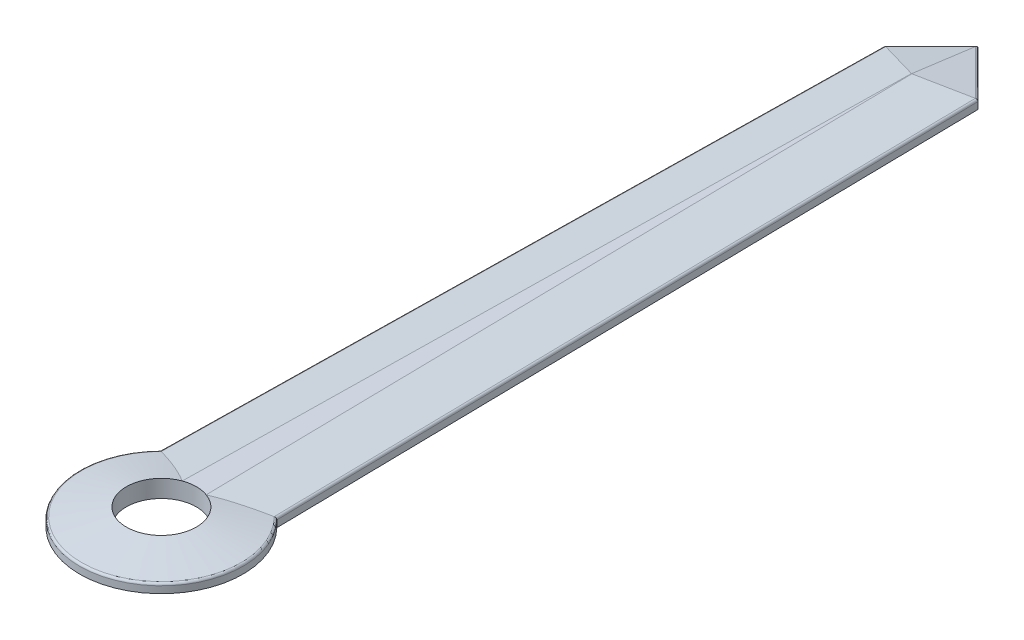
ISO-10303-21;
HEADER;
FILE_DESCRIPTION(('STEP AP214'),'2;1');
FILE_NAME('part.step','',(''),(''),'','','');
FILE_SCHEMA(('AUTOMOTIVE_DESIGN { 1 0 10303 214 1 1 1 1 }'));
ENDSEC;
DATA;
#1=APPLICATION_CONTEXT('core data for automotive mechanical design processes');
#2=APPLICATION_PROTOCOL_DEFINITION('international standard','automotive_design',2000,#1);
#3=PRODUCT_CONTEXT('',#1,'mechanical');
#4=PRODUCT('Part','Part','',(#3));
#5=PRODUCT_RELATED_PRODUCT_CATEGORY('part','',(#4));
#6=PRODUCT_DEFINITION_FORMATION('','',#4);
#7=PRODUCT_DEFINITION_CONTEXT('part definition',#1,'design');
#8=PRODUCT_DEFINITION('design','',#6,#7);
#9=PRODUCT_DEFINITION_SHAPE('','',#8);
#10=(LENGTH_UNIT() NAMED_UNIT(*) SI_UNIT(.MILLI.,.METRE.));
#11=(NAMED_UNIT(*) PLANE_ANGLE_UNIT() SI_UNIT($,.RADIAN.));
#12=(NAMED_UNIT(*) SI_UNIT($,.STERADIAN.) SOLID_ANGLE_UNIT());
#13=UNCERTAINTY_MEASURE_WITH_UNIT(LENGTH_MEASURE(1.E-05),#10,'distance_accuracy_value','');
#14=(GEOMETRIC_REPRESENTATION_CONTEXT(3) GLOBAL_UNCERTAINTY_ASSIGNED_CONTEXT((#13)) GLOBAL_UNIT_ASSIGNED_CONTEXT((#10,
#11,#12)) REPRESENTATION_CONTEXT('',''));
#15=CARTESIAN_POINT('',(0.,0.,0.));
#16=DIRECTION('',(0.,0.,1.));
#17=DIRECTION('',(1.,0.,0.));
#18=AXIS2_PLACEMENT_3D('',#15,#16,#17);
#19=CARTESIAN_POINT('',(0.,0.1905,0.));
#20=DIRECTION('',(0.,1.,0.));
#21=DIRECTION('',(0.,0.,1.));
#22=AXIS2_PLACEMENT_3D('',#19,#20,#21);
#23=PLANE('',#22);
#24=CARTESIAN_POINT('',(0.,0.1905,0.));
#25=DIRECTION('',(0.,1.,0.));
#26=DIRECTION('',(0.,0.,1.));
#27=AXIS2_PLACEMENT_3D('',#24,#25,#26);
#28=CIRCLE('',#27,0.380999999999999);
#29=CARTESIAN_POINT('',(0.130290982169233,0.1905,-0.358029691457812));
#30=VERTEX_POINT('',#29);
#31=CARTESIAN_POINT('',(-0.130290982169233,0.1905,-0.358029691457812));
#32=VERTEX_POINT('',#31);
#33=EDGE_CURVE('E171',#30,#32,#28,.T.);
#34=ORIENTED_EDGE('',*,*,#33,.F.);
#35=DIRECTION('',(-0.0163641472754282,0.,-0.999866098377152));
#36=VECTOR('',#35,1.);
#37=CARTESIAN_POINT('',(-0.000895722754283927,0.1905,-8.37367124021056));
#38=LINE('',#37,#36);
#39=CARTESIAN_POINT('',(0.00247458824657965,0.1905,-8.16774179860675));
#40=VERTEX_POINT('',#39);
#41=EDGE_CURVE('E212',#30,#40,#38,.T.);
#42=ORIENTED_EDGE('',*,*,#41,.T.);
#43=DIRECTION('',(-0.707106781186548,0.,-0.707106781186547));
#44=VECTOR('',#43,1.);
#45=CARTESIAN_POINT('',(-0.359891806573333,0.1905,-8.53010819342667));
#46=LINE('',#45,#44);
#47=CARTESIAN_POINT('',(0.,0.1905,-8.17021638685333));
#48=VERTEX_POINT('',#47);
#49=EDGE_CURVE('E208',#40,#48,#46,.T.);
#50=ORIENTED_EDGE('',*,*,#49,.T.);
#51=DIRECTION('',(-0.707106781186548,0.,0.707106781186547));
#52=VECTOR('',#51,1.);
#53=CARTESIAN_POINT('',(-0.148108193426666,0.1905,-8.02210819342667));
#54=LINE('',#53,#52);
#55=CARTESIAN_POINT('',(-0.00247458824657978,0.1905,-8.16774179860675));
#56=VERTEX_POINT('',#55);
#57=EDGE_CURVE('E205',#48,#56,#54,.T.);
#58=ORIENTED_EDGE('',*,*,#57,.T.);
#59=DIRECTION('',(-0.0163641472754282,0.,0.999866098377152));
#60=VECTOR('',#59,1.);
#61=CARTESIAN_POINT('',(-0.126104277245716,0.1905,-0.613841634877489));
#62=LINE('',#61,#60);
#63=EDGE_CURVE('E202',#56,#32,#62,.T.);
#64=ORIENTED_EDGE('',*,*,#63,.T.);
#65=EDGE_LOOP('',(#34,#42,#50,#58,#64));
#66=FACE_BOUND('',#65,.T.);
#67=ADVANCED_FACE('F43',(#66),#23,.T.);
#68=CARTESIAN_POINT('',(0.,0.,0.));
#69=DIRECTION('',(0.,1.,0.));
#70=DIRECTION('',(0.,0.,1.));
#71=AXIS2_PLACEMENT_3D('',#68,#69,#70);
#72=PLANE('',#71);
#73=CARTESIAN_POINT('',(0.,0.,0.));
#74=DIRECTION('',(0.,1.,0.));
#75=DIRECTION('',(0.,0.,1.));
#76=AXIS2_PLACEMENT_3D('',#73,#74,#75);
#77=CIRCLE('',#76,0.889);
#78=CARTESIAN_POINT('',(-0.635,0.,-0.622170394666927));
#79=VERTEX_POINT('',#78);
#80=CARTESIAN_POINT('',(0.635,0.,-0.622170394666927));
#81=VERTEX_POINT('',#80);
#82=EDGE_CURVE('E162',#79,#81,#77,.T.);
#83=ORIENTED_EDGE('',*,*,#82,.F.);
#84=DIRECTION('',(-0.0163641472754282,0.,0.999866098377152));
#85=VECTOR('',#84,1.);
#86=CARTESIAN_POINT('',(-0.635,0.,-0.622170394666927));
#87=LINE('',#86,#85);
#88=CARTESIAN_POINT('',(-0.508,0.,-8.382));
#89=VERTEX_POINT('',#88);
#90=EDGE_CURVE('E184',#89,#79,#87,.T.);
#91=ORIENTED_EDGE('',*,*,#90,.F.);
#92=DIRECTION('',(-0.707106781186548,0.,0.707106781186547));
#93=VECTOR('',#92,1.);
#94=CARTESIAN_POINT('',(-0.508,0.,-8.382));
#95=LINE('',#94,#93);
#96=CARTESIAN_POINT('',(0.,0.,-8.89));
#97=VERTEX_POINT('',#96);
#98=EDGE_CURVE('E180',#97,#89,#95,.T.);
#99=ORIENTED_EDGE('',*,*,#98,.F.);
#100=DIRECTION('',(-0.707106781186548,0.,-0.707106781186547));
#101=VECTOR('',#100,1.);
#102=CARTESIAN_POINT('',(0.,0.,-8.89));
#103=LINE('',#102,#101);
#104=CARTESIAN_POINT('',(0.508,0.,-8.382));
#105=VERTEX_POINT('',#104);
#106=EDGE_CURVE('E165',#105,#97,#103,.T.);
#107=ORIENTED_EDGE('',*,*,#106,.F.);
#108=DIRECTION('',(-0.0163641472754282,0.,-0.999866098377152));
#109=VECTOR('',#108,1.);
#110=CARTESIAN_POINT('',(0.508,0.,-8.382));
#111=LINE('',#110,#109);
#112=EDGE_CURVE('E149',#81,#105,#111,.T.);
#113=ORIENTED_EDGE('',*,*,#112,.F.);
#114=EDGE_LOOP('',(#83,#91,#99,#107,#113));
#115=FACE_BOUND('',#114,.T.);
#116=CARTESIAN_POINT('',(0.,0.,0.));
#117=DIRECTION('',(0.,1.,0.));
#118=DIRECTION('',(0.,0.,1.));
#119=AXIS2_PLACEMENT_3D('',#116,#117,#118);
#120=CIRCLE('',#119,0.380999999999999);
#121=CARTESIAN_POINT('',(0.,0.,0.380999999999999));
#122=VERTEX_POINT('',#121);
#123=EDGE_CURVE('E174',#122,#122,#120,.T.);
#124=ORIENTED_EDGE('',*,*,#123,.T.);
#125=EDGE_LOOP('',(#124));
#126=FACE_BOUND('',#125,.T.);
#127=ADVANCED_FACE('F159',(#115,#126),#72,.F.);
#128=CARTESIAN_POINT('',(0.,0.1905,0.));
#129=DIRECTION('',(0.,-1.,0.));
#130=DIRECTION('',(0.,0.,-1.));
#131=AXIS2_PLACEMENT_3D('',#128,#129,#130);
#132=CYLINDRICAL_SURFACE('',#131,0.889);
#133=DIRECTION('',(0.,-1.,0.));
#134=VECTOR('',#133,1.);
#135=CARTESIAN_POINT('',(0.635,0.1905,-0.622170394666927));
#136=LINE('',#135,#134);
#137=CARTESIAN_POINT('',(0.635,0.0741625137147924,-0.622170394666927));
#138=VERTEX_POINT('',#137);
#139=EDGE_CURVE('E145',#138,#81,#136,.T.);
#140=ORIENTED_EDGE('',*,*,#139,.F.);
#141=CARTESIAN_POINT('',(0.,0.0741625137147923,0.));
#142=DIRECTION('',(0.,1.,0.));
#143=DIRECTION('',(0.,0.,1.));
#144=AXIS2_PLACEMENT_3D('',#141,#142,#143);
#145=CIRCLE('',#144,0.889);
#146=CARTESIAN_POINT('',(-0.635,0.0741625137147924,-0.622170394666927));
#147=VERTEX_POINT('',#146);
#148=EDGE_CURVE('E57',#138,#147,#145,.F.);
#149=ORIENTED_EDGE('',*,*,#148,.T.);
#150=DIRECTION('',(0.,-1.,0.));
#151=VECTOR('',#150,1.);
#152=CARTESIAN_POINT('',(-0.635,0.1905,-0.622170394666927));
#153=LINE('',#152,#151);
#154=EDGE_CURVE('E169',#147,#79,#153,.T.);
#155=ORIENTED_EDGE('',*,*,#154,.T.);
#156=ORIENTED_EDGE('',*,*,#82,.T.);
#157=EDGE_LOOP('',(#140,#149,#155,#156));
#158=FACE_BOUND('',#157,.T.);
#159=ADVANCED_FACE('F168',(#158),#132,.T.);
#160=CARTESIAN_POINT('',(0.508,0.1905,-8.382));
#161=DIRECTION('',(-0.999866098377152,0.,0.0163641472754282));
#162=DIRECTION('',(0.0163641472754282,0.,0.999866098377152));
#163=AXIS2_PLACEMENT_3D('',#160,#161,#162);
#164=PLANE('',#163);
#165=DIRECTION('',(0.,-1.,0.));
#166=VECTOR('',#165,1.);
#167=CARTESIAN_POINT('',(0.508,0.1905,-8.382));
#168=LINE('',#167,#166);
#169=CARTESIAN_POINT('',(0.508,0.0741625137147924,-8.382));
#170=VERTEX_POINT('',#169);
#171=EDGE_CURVE('E155',#170,#105,#168,.T.);
#172=ORIENTED_EDGE('',*,*,#171,.F.);
#173=DIRECTION('',(0.0163641472754282,0.,0.999866098377152));
#174=VECTOR('',#173,1.);
#175=CARTESIAN_POINT('',(0.635,0.0741625137147924,-0.622170394666927));
#176=LINE('',#175,#174);
#177=EDGE_CURVE('E152',#170,#138,#176,.T.);
#178=ORIENTED_EDGE('',*,*,#177,.T.);
#179=ORIENTED_EDGE('',*,*,#139,.T.);
#180=ORIENTED_EDGE('',*,*,#112,.T.);
#181=EDGE_LOOP('',(#172,#178,#179,#180));
#182=FACE_BOUND('',#181,.T.);
#183=ADVANCED_FACE('F148',(#182),#164,.F.);
#184=CARTESIAN_POINT('',(0.,0.1905,-8.89));
#185=DIRECTION('',(-0.707106781186547,0.,0.707106781186548));
#186=DIRECTION('',(0.707106781186548,0.,0.707106781186547));
#187=AXIS2_PLACEMENT_3D('',#184,#185,#186);
#188=PLANE('',#187);
#189=DIRECTION('',(0.,-1.,0.));
#190=VECTOR('',#189,1.);
#191=CARTESIAN_POINT('',(0.,0.1905,-8.89));
#192=LINE('',#191,#190);
#193=CARTESIAN_POINT('',(0.,0.0741625137147924,-8.89));
#194=VERTEX_POINT('',#193);
#195=EDGE_CURVE('E191',#194,#97,#192,.T.);
#196=ORIENTED_EDGE('',*,*,#195,.F.);
#197=DIRECTION('',(0.707106781186548,0.,0.707106781186547));
#198=VECTOR('',#197,1.);
#199=CARTESIAN_POINT('',(0.508,0.0741625137147922,-8.382));
#200=LINE('',#199,#198);
#201=EDGE_CURVE('E216',#194,#170,#200,.T.);
#202=ORIENTED_EDGE('',*,*,#201,.T.);
#203=ORIENTED_EDGE('',*,*,#171,.T.);
#204=ORIENTED_EDGE('',*,*,#106,.T.);
#205=EDGE_LOOP('',(#196,#202,#203,#204));
#206=FACE_BOUND('',#205,.T.);
#207=ADVANCED_FACE('F346',(#206),#188,.F.);
#208=CARTESIAN_POINT('',(-0.508,0.1905,-8.382));
#209=DIRECTION('',(0.707106781186547,0.,0.707106781186548));
#210=DIRECTION('',(0.707106781186548,0.,-0.707106781186547));
#211=AXIS2_PLACEMENT_3D('',#208,#209,#210);
#212=PLANE('',#211);
#213=DIRECTION('',(0.,-1.,0.));
#214=VECTOR('',#213,1.);
#215=CARTESIAN_POINT('',(-0.508,0.1905,-8.382));
#216=LINE('',#215,#214);
#217=CARTESIAN_POINT('',(-0.508,0.0741625137147924,-8.382));
#218=VERTEX_POINT('',#217);
#219=EDGE_CURVE('E188',#218,#89,#216,.T.);
#220=ORIENTED_EDGE('',*,*,#219,.F.);
#221=DIRECTION('',(0.707106781186548,0.,-0.707106781186547));
#222=VECTOR('',#221,1.);
#223=CARTESIAN_POINT('',(0.,0.0741625137147922,-8.89));
#224=LINE('',#223,#222);
#225=EDGE_CURVE('E314',#218,#194,#224,.T.);
#226=ORIENTED_EDGE('',*,*,#225,.T.);
#227=ORIENTED_EDGE('',*,*,#195,.T.);
#228=ORIENTED_EDGE('',*,*,#98,.T.);
#229=EDGE_LOOP('',(#220,#226,#227,#228));
#230=FACE_BOUND('',#229,.T.);
#231=ADVANCED_FACE('F348',(#230),#212,.F.);
#232=CARTESIAN_POINT('',(-0.635,0.1905,-0.622170394666927));
#233=DIRECTION('',(0.999866098377152,0.,0.0163641472754282));
#234=DIRECTION('',(0.0163641472754282,0.,-0.999866098377152));
#235=AXIS2_PLACEMENT_3D('',#232,#233,#234);
#236=PLANE('',#235);
#237=ORIENTED_EDGE('',*,*,#154,.F.);
#238=DIRECTION('',(0.0163641472754282,0.,-0.999866098377152));
#239=VECTOR('',#238,1.);
#240=CARTESIAN_POINT('',(-0.508,0.0741625137147924,-8.382));
#241=LINE('',#240,#239);
#242=EDGE_CURVE('E287',#147,#218,#241,.T.);
#243=ORIENTED_EDGE('',*,*,#242,.T.);
#244=ORIENTED_EDGE('',*,*,#219,.T.);
#245=ORIENTED_EDGE('',*,*,#90,.T.);
#246=EDGE_LOOP('',(#237,#243,#244,#245));
#247=FACE_BOUND('',#246,.T.);
#248=ADVANCED_FACE('F349',(#247),#236,.F.);
#249=CARTESIAN_POINT('',(0.,0.1905,0.));
#250=DIRECTION('',(0.,-1.,0.));
#251=DIRECTION('',(0.,0.,-1.));
#252=AXIS2_PLACEMENT_3D('',#249,#250,#251);
#253=CYLINDRICAL_SURFACE('',#252,0.380999999999999);
#254=CARTESIAN_POINT('',(0.,0.190319615913308,0.));
#255=DIRECTION('',(0.,-1.,0.));
#256=DIRECTION('',(0.,0.,-1.));
#257=AXIS2_PLACEMENT_3D('',#254,#255,#256);
#258=CIRCLE('',#257,0.380999999999999);
#259=CARTESIAN_POINT('',(-0.131260785505618,0.190319615913316,-0.357675280370964));
#260=VERTEX_POINT('',#259);
#261=CARTESIAN_POINT('',(0.131260785505618,0.190319615913308,-0.357675280370964));
#262=VERTEX_POINT('',#261);
#263=EDGE_CURVE('E197',#260,#262,#258,.F.);
#264=ORIENTED_EDGE('',*,*,#263,.T.);
#265=CARTESIAN_POINT('',(0.,0.215976483675146,0.));
#266=DIRECTION('',(0.183926719228348,0.982935349149554,-0.00301020699294048));
#267=DIRECTION('',(0.982803732511148,-0.18395135061272,-0.0160848988157077));
#268=AXIS2_PLACEMENT_3D('',#265,#266,#267);
#269=ELLIPSE('',#268,0.387614506213094,0.380999999999999);
#270=EDGE_CURVE('E200',#262,#30,#269,.T.);
#271=ORIENTED_EDGE('',*,*,#270,.T.);
#272=ORIENTED_EDGE('',*,*,#33,.T.);
#273=CARTESIAN_POINT('',(0.,0.215976483675146,0.));
#274=DIRECTION('',(-0.183926719228348,0.982935349149554,-0.00301020699294048));
#275=DIRECTION('',(-0.982803732511148,-0.18395135061272,-0.0160848988157078));
#276=AXIS2_PLACEMENT_3D('',#273,#274,#275);
#277=ELLIPSE('',#276,0.387614506213094,0.380999999999999);
#278=EDGE_CURVE('E154',#32,#260,#277,.T.);
#279=ORIENTED_EDGE('',*,*,#278,.T.);
#280=EDGE_LOOP('',(#264,#271,#272,#279));
#281=FACE_BOUND('',#280,.T.);
#282=ORIENTED_EDGE('',*,*,#123,.F.);
#283=EDGE_LOOP('',(#282));
#284=FACE_BOUND('',#283,.T.);
#285=ADVANCED_FACE('F249',(#281,#284),#253,.F.);
#286=CARTESIAN_POINT('',(-4.08510819342667,0.1905,-4.08510819342667));
#287=DIRECTION('',(-0.130073247426679,0.982935349149554,-0.130073247426679));
#288=DIRECTION('',(0.,0.13118776787575,0.991357538711326));
#289=AXIS2_PLACEMENT_3D('',#286,#287,#288);
#290=PLANE('',#289);
#291=DIRECTION('',(0.,-0.13118776787575,-0.991357538711326));
#292=VECTOR('',#291,1.);
#293=CARTESIAN_POINT('',(0.,0.721784590194362,-4.15541384680878));
#294=LINE('',#293,#292);
#295=CARTESIAN_POINT('',(0.,0.099129071583191,-8.860686696485));
#296=VERTEX_POINT('',#295);
#297=EDGE_CURVE('E318',#296,#48,#294,.F.);
#298=ORIENTED_EDGE('',*,*,#297,.F.);
#299=DIRECTION('',(0.707106781186548,0.,-0.707106781186547));
#300=VECTOR('',#299,1.);
#301=CARTESIAN_POINT('',(-0.493343348242499,0.0991290715831909,-8.3673433482425));
#302=LINE('',#301,#300);
#303=CARTESIAN_POINT('',(-0.487412396227678,0.0991290715831911,-8.37327430025732));
#304=VERTEX_POINT('',#303);
#305=EDGE_CURVE('E311',#296,#304,#302,.F.);
#306=ORIENTED_EDGE('',*,*,#305,.T.);
#307=DIRECTION('',(-0.907167863131854,-0.170926598256659,-0.384487406957877));
#308=VECTOR('',#307,1.);
#309=CARTESIAN_POINT('',(2.73563364095255,0.706408404933815,-7.00724198837286));
#310=LINE('',#309,#308);
#311=EDGE_CURVE('E322',#56,#304,#310,.T.);
#312=ORIENTED_EDGE('',*,*,#311,.F.);
#313=ORIENTED_EDGE('',*,*,#57,.F.);
#314=EDGE_LOOP('',(#298,#306,#312,#313));
#315=FACE_BOUND('',#314,.T.);
#316=ADVANCED_FACE('F245',(#315),#290,.T.);
#317=CARTESIAN_POINT('',(4.08510819342667,0.1905,-4.08510819342667));
#318=DIRECTION('',(0.130073247426679,0.982935349149554,-0.130073247426679));
#319=DIRECTION('',(0.,0.13118776787575,0.991357538711326));
#320=AXIS2_PLACEMENT_3D('',#317,#318,#319);
#321=PLANE('',#320);
#322=DIRECTION('',(0.907167863131854,-0.170926598256659,-0.384487406957878));
#323=VECTOR('',#322,1.);
#324=CARTESIAN_POINT('',(1.93829169872956,-0.174242455050791,-8.98820439588696));
#325=LINE('',#324,#323);
#326=CARTESIAN_POINT('',(0.487412396227678,0.099129071583191,-8.37327430025732));
#327=VERTEX_POINT('',#326);
#328=EDGE_CURVE('E319',#327,#40,#325,.F.);
#329=ORIENTED_EDGE('',*,*,#328,.F.);
#330=DIRECTION('',(0.707106781186548,0.,0.707106781186547));
#331=VECTOR('',#330,1.);
#332=CARTESIAN_POINT('',(-0.0146566517575008,0.0991290715831909,-8.8753433482425));
#333=LINE('',#332,#331);
#334=EDGE_CURVE('E309',#327,#296,#333,.F.);
#335=ORIENTED_EDGE('',*,*,#334,.T.);
#336=ORIENTED_EDGE('',*,*,#297,.T.);
#337=ORIENTED_EDGE('',*,*,#49,.F.);
#338=EDGE_LOOP('',(#329,#335,#336,#337));
#339=FACE_BOUND('',#338,.T.);
#340=ADVANCED_FACE('F242',(#339),#321,.T.);
#341=CARTESIAN_POINT('',(-0.136114158247782,0.1905,-0.00222769042320052));
#342=DIRECTION('',(-0.183926719228348,0.982935349149554,-0.00301020699294048));
#343=DIRECTION('',(-0.982939802538536,-0.183927552545845,0.));
#344=AXIS2_PLACEMENT_3D('',#341,#342,#343);
#345=PLANE('',#344);
#346=ORIENTED_EDGE('',*,*,#311,.T.);
#347=DIRECTION('',(0.0163641472754282,0.,-0.999866098377152));
#348=VECTOR('',#347,1.);
#349=CARTESIAN_POINT('',(-0.61427513976962,0.0991290715831911,-0.621831204583752));
#350=LINE('',#349,#348);
#351=CARTESIAN_POINT('',(-0.61441131251624,0.0991290715831926,-0.613510910798519));
#352=VERTEX_POINT('',#351);
#353=EDGE_CURVE('E65',#304,#352,#350,.F.);
#354=ORIENTED_EDGE('',*,*,#353,.T.);
#355=CARTESIAN_POINT('',(-1.47147255137392,-0.0621517655911384,-0.909893903828372));
#356=CARTESIAN_POINT('',(-1.40126561664907,-0.0489516430604869,-0.88931861528272));
#357=CARTESIAN_POINT('',(-1.33123256726205,-0.0357822712731719,-0.868159922647089));
#358=CARTESIAN_POINT('',(-1.19155517359173,-0.00951179945482843,-0.824385318027376));
#359=CARTESIAN_POINT('',(-1.12191114060924,0.00358924546163034,-0.801768382035371));
#360=CARTESIAN_POINT('',(-0.91180737219843,0.0431215576781161,-0.730673507034872));
#361=CARTESIAN_POINT('',(-0.772172257976581,0.0694067199513363,-0.679518649929991));
#362=CARTESIAN_POINT('',(-0.560869877669018,0.109216129447022,-0.591178463493681));
#363=CARTESIAN_POINT('',(-0.487459031921342,0.123053207294985,-0.558377751854708));
#364=CARTESIAN_POINT('',(-0.343527602704058,0.150202761355517,-0.487478697250913));
#365=CARTESIAN_POINT('',(-0.272995184279456,0.163517374645867,-0.449405653260168));
#366=CARTESIAN_POINT('',(-0.149537241978278,0.186855719724566,-0.372045498655669));
#367=CARTESIAN_POINT('',(-0.0957633088371803,0.197033555626133,-0.334276805966505));
#368=CARTESIAN_POINT('',(-0.021155913531705,0.211192563180673,-0.2694654537962));
#369=CARTESIAN_POINT('',(0.00286274626934901,0.215757892030189,-0.246294353145887));
#370=CARTESIAN_POINT('',(0.046850909684194,0.224142164765649,-0.196264748147143));
#371=CARTESIAN_POINT('',(0.0668457581203295,0.227965774640298,-0.169431233703665));
#372=CARTESIAN_POINT('',(0.0904704545488148,0.232515842293267,-0.127171870621056));
#373=CARTESIAN_POINT('',(0.0970812378010598,0.233794733459666,-0.113495847626509));
#374=CARTESIAN_POINT('',(0.108231955058883,0.23596765023619,-0.0852845424472507));
#375=CARTESIAN_POINT('',(0.112773698416452,0.236862012074228,-0.0707500236230778));
#376=CARTESIAN_POINT('',(0.119326509505099,0.23817953496342,-0.0409172659247494));
#377=CARTESIAN_POINT('',(0.121310138991908,0.238597581619502,-0.0256125469164558));
#378=CARTESIAN_POINT('',(0.122346333093547,0.23888548850571,0.0050863632700086));
#379=CARTESIAN_POINT('',(0.121403083838638,0.238756131556419,0.0204803952626585));
#380=CARTESIAN_POINT('',(0.116963744366099,0.238013338117826,0.0491811513962582));
#381=CARTESIAN_POINT('',(0.113750978057984,0.237453062228181,0.0625352461760626));
#382=CARTESIAN_POINT('',(0.105382207931775,0.235967093264305,0.0886560448923355));
#383=CARTESIAN_POINT('',(0.100217020058462,0.235039672173734,0.101419647647132));
#384=CARTESIAN_POINT('',(0.0846088482750408,0.2322186806122,0.133944820840169));
#385=CARTESIAN_POINT('',(0.0728899550909656,0.230084371444411,0.153056346869973));
#386=CARTESIAN_POINT('',(0.04690333013583,0.225331855140782,0.189006831279379));
#387=CARTESIAN_POINT('',(0.0326746133775238,0.222721036354855,0.205874481043181));
#388=CARTESIAN_POINT('',(0.017766486995649,0.219980200210557,0.221799645962157));
#389=B_SPLINE_CURVE_WITH_KNOTS('',3,(#355,#356,#357,#358,#359,#360,#361,#362,#363,#364,#365,
#366,#367,#368,#369,#370,#371,#372,#373,#374,#375,#376,#377,#378,#379,#380,#381,#382,#383,#384,
#385,#386,#387,#388),.UNSPECIFIED.,.F.,.F.,(4,2,2,2,2,2,2,2,2,2,2,2,2,2,2,2,4),(0.,
0.223001286945015,0.446160912348124,0.898804041303776,1.14341976037625,1.38689994820208,
1.58548346483561,1.68631638916805,1.78649281752304,1.83209118392024,1.87764959815471,
1.9236927138026,1.96967000725155,2.01073823503396,2.05200209870585,2.11922986502013,
2.18549230719106),.UNSPECIFIED.);
#390=EDGE_CURVE('E224',#260,#352,#389,.F.);
#391=ORIENTED_EDGE('',*,*,#390,.F.);
#392=ORIENTED_EDGE('',*,*,#278,.F.);
#393=ORIENTED_EDGE('',*,*,#63,.F.);
#394=EDGE_LOOP('',(#346,#354,#391,#392,#393));
#395=FACE_BOUND('',#394,.T.);
#396=ADVANCED_FACE('F237',(#395),#345,.T.);
#397=CARTESIAN_POINT('',(0.136114158247782,0.1905,-0.00222769042320051));
#398=DIRECTION('',(0.183926719228348,0.982935349149554,-0.00301020699294048));
#399=DIRECTION('',(-0.982939802538536,0.183927552545845,0.));
#400=AXIS2_PLACEMENT_3D('',#397,#398,#399);
#401=PLANE('',#400);
#402=CARTESIAN_POINT('',(1.47147255137392,-0.0621517655911384,-0.909893903828373));
#403=CARTESIAN_POINT('',(1.40126561664907,-0.0489516430604868,-0.88931861528272));
#404=CARTESIAN_POINT('',(1.33123256726205,-0.0357822712731718,-0.868159922647089));
#405=CARTESIAN_POINT('',(1.19155517359173,-0.0095117994548283,-0.824385318027376));
#406=CARTESIAN_POINT('',(1.12191114060923,0.00358924546163044,-0.801768382035371));
#407=CARTESIAN_POINT('',(0.91180737219843,0.0431215576781161,-0.730673507034872));
#408=CARTESIAN_POINT('',(0.772172257976581,0.0694067199513363,-0.679518649929991));
#409=CARTESIAN_POINT('',(0.560869877669018,0.109216129447022,-0.591178463493681));
#410=CARTESIAN_POINT('',(0.487459031921342,0.123053207294985,-0.558377751854708));
#411=CARTESIAN_POINT('',(0.343527602704058,0.150202761355517,-0.487478697250913));
#412=CARTESIAN_POINT('',(0.272995184279456,0.163517374645867,-0.449405653260168));
#413=CARTESIAN_POINT('',(0.149537241978278,0.186855719724566,-0.372045498655669));
#414=CARTESIAN_POINT('',(0.0957633088371803,0.197033555626133,-0.334276805966505));
#415=CARTESIAN_POINT('',(0.021155913531705,0.211192563180673,-0.2694654537962));
#416=CARTESIAN_POINT('',(-0.00286274626934911,0.215757892030189,-0.246294353145887));
#417=CARTESIAN_POINT('',(-0.0468509096841942,0.224142164765649,-0.196264748147143));
#418=CARTESIAN_POINT('',(-0.0668457581203296,0.227965774640298,-0.169431233703665));
#419=CARTESIAN_POINT('',(-0.0904704545488149,0.232515842293267,-0.127171870621056));
#420=CARTESIAN_POINT('',(-0.0970812378010599,0.233794733459666,-0.113495847626509));
#421=CARTESIAN_POINT('',(-0.108231955058884,0.23596765023619,-0.0852845424472503));
#422=CARTESIAN_POINT('',(-0.112773698416452,0.236862012074228,-0.0707500236230774));
#423=CARTESIAN_POINT('',(-0.119326509505099,0.23817953496342,-0.0409172659247491));
#424=CARTESIAN_POINT('',(-0.121310138991908,0.238597581619502,-0.0256125469164555));
#425=CARTESIAN_POINT('',(-0.122346333093547,0.23888548850571,0.0050863632700088));
#426=CARTESIAN_POINT('',(-0.121403083838638,0.238756131556419,0.0204803952626587));
#427=CARTESIAN_POINT('',(-0.116963744366099,0.238013338117826,0.0491811513962584));
#428=CARTESIAN_POINT('',(-0.113750978057984,0.237453062228181,0.0625352461760627));
#429=CARTESIAN_POINT('',(-0.105382207931775,0.235967093264305,0.0886560448923356));
#430=CARTESIAN_POINT('',(-0.100217020058462,0.235039672173734,0.101419647647132));
#431=CARTESIAN_POINT('',(-0.0846088482750408,0.2322186806122,0.133944820840169));
#432=CARTESIAN_POINT('',(-0.0728899550909655,0.230084371444411,0.153056346869973));
#433=CARTESIAN_POINT('',(-0.04690333013583,0.225331855140782,0.189006831279379));
#434=CARTESIAN_POINT('',(-0.0326746133775237,0.222721036354855,0.205874481043181));
#435=CARTESIAN_POINT('',(-0.017766486995649,0.219980200210557,0.221799645962157));
#436=B_SPLINE_CURVE_WITH_KNOTS('',3,(#402,#403,#404,#405,#406,#407,#408,#409,#410,#411,#412,
#413,#414,#415,#416,#417,#418,#419,#420,#421,#422,#423,#424,#425,#426,#427,#428,#429,#430,#431,
#432,#433,#434,#435),.UNSPECIFIED.,.F.,.F.,(4,2,2,2,2,2,2,2,2,2,2,2,2,2,2,2,4),(0.,
0.223001286945015,0.446160912348125,0.898804041303776,1.14341976037625,1.38689994820208,
1.58548346483561,1.68631638916805,1.78649281752304,1.83209118392024,1.87764959815471,
1.9236927138026,1.96967000725155,2.01073823503396,2.05200209870585,2.11922986502013,
2.18549230719106),.UNSPECIFIED.);
#437=CARTESIAN_POINT('',(0.614411312516249,0.099129071583191,-0.613510910798523));
#438=VERTEX_POINT('',#437);
#439=EDGE_CURVE('E217',#438,#262,#436,.T.);
#440=ORIENTED_EDGE('',*,*,#439,.F.);
#441=DIRECTION('',(0.0163641472754282,0.,0.999866098377152));
#442=VECTOR('',#441,1.);
#443=CARTESIAN_POINT('',(0.487275139769621,0.0991290715831911,-8.38166080991682));
#444=LINE('',#443,#442);
#445=EDGE_CURVE('E291',#438,#327,#444,.F.);
#446=ORIENTED_EDGE('',*,*,#445,.T.);
#447=ORIENTED_EDGE('',*,*,#328,.T.);
#448=ORIENTED_EDGE('',*,*,#41,.F.);
#449=ORIENTED_EDGE('',*,*,#270,.F.);
#450=EDGE_LOOP('',(#440,#446,#447,#448,#449));
#451=FACE_BOUND('',#450,.T.);
#452=ADVANCED_FACE('F230',(#451),#401,.T.);
#453=CARTESIAN_POINT('',(0.,0.1905,0.));
#454=DIRECTION('',(0.,-1.,0.));
#455=DIRECTION('',(0.,0.,-1.));
#456=AXIS2_PLACEMENT_3D('',#453,#454,#455);
#457=CONICAL_SURFACE('',#456,0.380036126157037,1.3857914260835);
#458=ORIENTED_EDGE('',*,*,#390,.T.);
#459=CARTESIAN_POINT('',(0.,0.0991290715831915,0.));
#460=DIRECTION('',(0.,-1.,0.));
#461=DIRECTION('',(0.,0.,-1.));
#462=AXIS2_PLACEMENT_3D('',#459,#460,#461);
#463=CIRCLE('',#462,0.868272364305563);
#464=EDGE_CURVE('E11',#352,#438,#463,.F.);
#465=ORIENTED_EDGE('',*,*,#464,.T.);
#466=ORIENTED_EDGE('',*,*,#439,.T.);
#467=ORIENTED_EDGE('',*,*,#263,.F.);
#468=EDGE_LOOP('',(#458,#465,#466,#467));
#469=FACE_BOUND('',#468,.T.);
#470=ADVANCED_FACE('F233',(#469),#457,.T.);
#471=CARTESIAN_POINT('',(-0.60960340110122,0.0741625137147924,-0.621754745326131));
#472=DIRECTION('',(-0.0163641472754282,0.,0.999866098377152));
#473=DIRECTION('',(0.999866098377152,0.,0.0163641472754282));
#474=AXIS2_PLACEMENT_3D('',#471,#472,#473);
#475=CYLINDRICAL_SURFACE('',#474,0.0254);
#476=CARTESIAN_POINT('',(-0.482771597517158,0.0741625137147923,-8.37130737799856));
#477=DIRECTION('',(-0.390230125096571,0.,0.920717355906314));
#478=DIRECTION('',(0.920717355906314,0.,0.390230125096571));
#479=AXIS2_PLACEMENT_3D('',#476,#477,#478);
#480=ELLIPSE('',#479,0.027400811248973,0.0254);
#481=EDGE_CURVE('E269',#218,#304,#480,.F.);
#482=ORIENTED_EDGE('',*,*,#481,.F.);
#483=ORIENTED_EDGE('',*,*,#242,.F.);
#484=CARTESIAN_POINT('',(-0.614411312516244,0.0991290715831918,-0.613510910798521));
#485=CARTESIAN_POINT('',(-0.615855504745691,0.0988578641837582,-0.614122412033887));
#486=CARTESIAN_POINT('',(-0.617280206082518,0.0984570881369223,-0.614724736716265));
#487=CARTESIAN_POINT('',(-0.620053605301677,0.0974046681741702,-0.615895732709027));
#488=CARTESIAN_POINT('',(-0.621402078397223,0.0967523225803079,-0.616464304711751));
#489=CARTESIAN_POINT('',(-0.623979632369687,0.0952053386043514,-0.617549798332686));
#490=CARTESIAN_POINT('',(-0.625208504409013,0.0943102863885974,-0.618066629649018));
#491=CARTESIAN_POINT('',(-0.627499370321241,0.092298405710771,-0.619029111274167));
#492=CARTESIAN_POINT('',(-0.628561591374638,0.0911818839468188,-0.619474858499512));
#493=CARTESIAN_POINT('',(-0.630427891918803,0.0888184052931962,-0.620257377039656));
#494=CARTESIAN_POINT('',(-0.631242554949452,0.0875813043809572,-0.620598623550746));
#495=CARTESIAN_POINT('',(-0.632651251667104,0.0849669448361767,-0.621188358472887));
#496=CARTESIAN_POINT('',(-0.633245369034806,0.0835897396160308,-0.62143688206558));
#497=CARTESIAN_POINT('',(-0.634137117005031,0.0808847069788856,-0.621809785488046));
#498=CARTESIAN_POINT('',(-0.634458802933769,0.0795661646979716,-0.621944240194083));
#499=CARTESIAN_POINT('',(-0.63489117880377,0.076886377341871,-0.622124926170165));
#500=CARTESIAN_POINT('',(-0.635001430429763,0.0755250494909945,-0.622170974168326));
#501=CARTESIAN_POINT('',(-0.635000000044382,0.0741625137322058,-0.622170394687084));
#502=B_SPLINE_CURVE_WITH_KNOTS('',3,(#484,#485,#486,#487,#488,#489,#490,#491,#492,#493,#494,
#495,#496,#497,#498,#499,#500,#501),.UNSPECIFIED.,.F.,.F.,(4,2,2,2,2,2,2,2,4),(0.,
0.00477095699539063,0.00955531853388507,0.0143478896415343,0.0191338696051785,
0.0236699260775635,0.0282042596899899,0.0322762238796967,0.0363566203948863),.UNSPECIFIED.);
#503=EDGE_CURVE('E48',#352,#147,#502,.T.);
#504=ORIENTED_EDGE('',*,*,#503,.F.);
#505=ORIENTED_EDGE('',*,*,#353,.F.);
#506=EDGE_LOOP('',(#482,#483,#504,#505));
#507=FACE_BOUND('',#506,.T.);
#508=ADVANCED_FACE('F45',(#507),#475,.T.);
#509=CARTESIAN_POINT('',(0.,0.0741625137147923,0.));
#510=DIRECTION('',(0.,1.,0.));
#511=DIRECTION('',(0.,0.,1.));
#512=AXIS2_PLACEMENT_3D('',#509,#510,#511);
#513=TOROIDAL_SURFACE('',#512,0.8636,0.0254);
#514=ORIENTED_EDGE('',*,*,#503,.T.);
#515=ORIENTED_EDGE('',*,*,#148,.F.);
#516=CARTESIAN_POINT('',(0.635,0.0741625137147924,-0.622170394666927));
#517=CARTESIAN_POINT('',(0.635001494325591,0.07551809218073,-0.622171001162093));
#518=CARTESIAN_POINT('',(0.63489230636332,0.0768727255445426,-0.622125397266721));
#519=CARTESIAN_POINT('',(0.634464236346081,0.0795389615351297,-0.621946510998784));
#520=CARTESIAN_POINT('',(0.634145908213204,0.0808506682481975,-0.621813460234897));
#521=CARTESIAN_POINT('',(0.633311199413417,0.08339720923481,-0.621464411792394));
#522=CARTESIAN_POINT('',(0.632794857478648,0.0846320584870539,-0.621248430335279));
#523=CARTESIAN_POINT('',(0.631583718292565,0.0869941042753445,-0.620741479164581));
#524=CARTESIAN_POINT('',(0.630888872905967,0.088121271661223,-0.620450489224121));
#525=CARTESIAN_POINT('',(0.629321687546514,0.0902730447626433,-0.619793637325921));
#526=CARTESIAN_POINT('',(0.628444790477159,0.0912937354378698,-0.619425851288461));
#527=CARTESIAN_POINT('',(0.62655433572618,0.0931736458934321,-0.618632180478572));
#528=CARTESIAN_POINT('',(0.625540695209363,0.0940327670385129,-0.618206260488434));
#529=CARTESIAN_POINT('',(0.623332881457135,0.0956267556058752,-0.617277548861883));
#530=CARTESIAN_POINT('',(0.622131118864066,0.0963492000318741,-0.616771499315864));
#531=CARTESIAN_POINT('',(0.619639966265064,0.0975799029834918,-0.615721170024663));
#532=CARTESIAN_POINT('',(0.618350666352798,0.0980883779598293,-0.615176929566887));
#533=CARTESIAN_POINT('',(0.6161699511085,0.0987486425713385,-0.614255197358504));
#534=CARTESIAN_POINT('',(0.615294133024222,0.0989629596305378,-0.613884704386255));
#535=CARTESIAN_POINT('',(0.614411312516254,0.09912907158319,-0.613510910798525));
#536=B_SPLINE_CURVE_WITH_KNOTS('',3,(#516,#517,#518,#519,#520,#521,#522,#523,#524,#525,#526,
#527,#528,#529,#530,#531,#532,#533,#534,#535),.UNSPECIFIED.,.F.,.F.,(4,2,2,2,2,2,2,2,2,4),(0.,
0.00406011754097741,0.00810952469981866,0.0121581401851923,0.0162078485692884,
0.0203748249219063,0.0245443369380715,0.0289973959524856,0.0334459393760214,0.0363651033581965),.UNSPECIFIED.);
#537=EDGE_CURVE('E263',#438,#138,#536,.F.);
#538=ORIENTED_EDGE('',*,*,#537,.F.);
#539=ORIENTED_EDGE('',*,*,#464,.F.);
#540=EDGE_LOOP('',(#514,#515,#538,#539));
#541=FACE_BOUND('',#540,.T.);
#542=ADVANCED_FACE('F260',(#541),#513,.T.);
#543=CARTESIAN_POINT('',(-0.490039487757862,0.0741625137147922,-8.36403948775786));
#544=DIRECTION('',(-0.707106781186548,0.,0.707106781186547));
#545=DIRECTION('',(0.707106781186547,0.,0.707106781186548));
#546=AXIS2_PLACEMENT_3D('',#543,#544,#545);
#547=CYLINDRICAL_SURFACE('',#546,0.0254);
#548=ORIENTED_EDGE('',*,*,#481,.T.);
#549=ORIENTED_EDGE('',*,*,#305,.F.);
#550=CARTESIAN_POINT('',(0.,0.0741625137147922,-8.85407897551572));
#551=DIRECTION('',(-1.,0.,0.));
#552=DIRECTION('',(0.,0.,1.));
#553=AXIS2_PLACEMENT_3D('',#550,#551,#552);
#554=ELLIPSE('',#553,0.0359210244842766,0.0254);
#555=EDGE_CURVE('E270',#194,#296,#554,.F.);
#556=ORIENTED_EDGE('',*,*,#555,.F.);
#557=ORIENTED_EDGE('',*,*,#225,.F.);
#558=EDGE_LOOP('',(#548,#549,#556,#557));
#559=FACE_BOUND('',#558,.T.);
#560=ADVANCED_FACE('F258',(#559),#547,.T.);
#561=CARTESIAN_POINT('',(0.482603401101221,0.0741625137147924,-8.3815843506592));
#562=DIRECTION('',(-0.0163641472754282,0.,-0.999866098377152));
#563=DIRECTION('',(-0.999866098377152,0.,0.0163641472754282));
#564=AXIS2_PLACEMENT_3D('',#561,#562,#563);
#565=CYLINDRICAL_SURFACE('',#564,0.0254);
#566=ORIENTED_EDGE('',*,*,#537,.T.);
#567=ORIENTED_EDGE('',*,*,#177,.F.);
#568=CARTESIAN_POINT('',(0.482771597517158,0.0741625137147923,-8.37130737799856));
#569=DIRECTION('',(-0.390230125096571,0.,-0.920717355906314));
#570=DIRECTION('',(0.920717355906314,0.,-0.390230125096571));
#571=AXIS2_PLACEMENT_3D('',#568,#569,#570);
#572=ELLIPSE('',#571,0.027400811248973,0.0254);
#573=EDGE_CURVE('E299',#327,#170,#572,.T.);
#574=ORIENTED_EDGE('',*,*,#573,.F.);
#575=ORIENTED_EDGE('',*,*,#445,.F.);
#576=EDGE_LOOP('',(#566,#567,#574,#575));
#577=FACE_BOUND('',#576,.T.);
#578=ADVANCED_FACE('F254',(#577),#565,.T.);
#579=CARTESIAN_POINT('',(-0.0179605122421383,0.0741625137147922,-8.87203948775786));
#580=DIRECTION('',(-0.707106781186548,0.,-0.707106781186547));
#581=DIRECTION('',(-0.707106781186547,0.,0.707106781186548));
#582=AXIS2_PLACEMENT_3D('',#579,#580,#581);
#583=CYLINDRICAL_SURFACE('',#582,0.0254);
#584=ORIENTED_EDGE('',*,*,#555,.T.);
#585=ORIENTED_EDGE('',*,*,#334,.F.);
#586=ORIENTED_EDGE('',*,*,#573,.T.);
#587=ORIENTED_EDGE('',*,*,#201,.F.);
#588=EDGE_LOOP('',(#584,#585,#586,#587));
#589=FACE_BOUND('',#588,.T.);
#590=ADVANCED_FACE('F251',(#589),#583,.T.);
#591=CLOSED_SHELL('',(#67,#127,#159,#183,#207,#231,#248,#285,#316,#340,#396,#452,#470,#508,#542,
#560,#578,#590));
#592=MANIFOLD_SOLID_BREP('B2',#591);
#593=ADVANCED_BREP_SHAPE_REPRESENTATION('',(#18,#592),#14);
#594=SHAPE_DEFINITION_REPRESENTATION(#9,#593);
ENDSEC;
END-ISO-10303-21;
